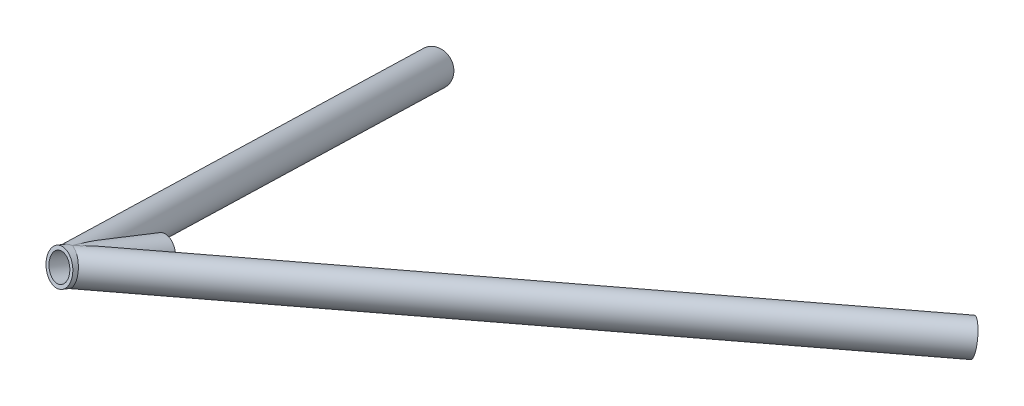
ISO-10303-21;
HEADER;
FILE_DESCRIPTION(('STEP AP214'),'2;1');
FILE_NAME('part.step','',(''),(''),'','','');
FILE_SCHEMA(('AUTOMOTIVE_DESIGN { 1 0 10303 214 1 1 1 1 }'));
ENDSEC;
DATA;
#1=APPLICATION_CONTEXT('core data for automotive mechanical design processes');
#2=APPLICATION_PROTOCOL_DEFINITION('international standard','automotive_design',2000,#1);
#3=PRODUCT_CONTEXT('',#1,'mechanical');
#4=PRODUCT('Part','Part','',(#3));
#5=PRODUCT_RELATED_PRODUCT_CATEGORY('part','',(#4));
#6=PRODUCT_DEFINITION_FORMATION('','',#4);
#7=PRODUCT_DEFINITION_CONTEXT('part definition',#1,'design');
#8=PRODUCT_DEFINITION('design','',#6,#7);
#9=PRODUCT_DEFINITION_SHAPE('','',#8);
#10=(LENGTH_UNIT() NAMED_UNIT(*) SI_UNIT(.MILLI.,.METRE.));
#11=(NAMED_UNIT(*) PLANE_ANGLE_UNIT() SI_UNIT($,.RADIAN.));
#12=(NAMED_UNIT(*) SI_UNIT($,.STERADIAN.) SOLID_ANGLE_UNIT());
#13=UNCERTAINTY_MEASURE_WITH_UNIT(LENGTH_MEASURE(1.E-05),#10,'distance_accuracy_value','');
#14=(GEOMETRIC_REPRESENTATION_CONTEXT(3) GLOBAL_UNCERTAINTY_ASSIGNED_CONTEXT((#13)) GLOBAL_UNIT_ASSIGNED_CONTEXT((#10,
#11,#12)) REPRESENTATION_CONTEXT('',''));
#15=CARTESIAN_POINT('',(0.,0.,0.));
#16=DIRECTION('',(0.,0.,1.));
#17=DIRECTION('',(1.,0.,0.));
#18=AXIS2_PLACEMENT_3D('',#15,#16,#17);
#19=CARTESIAN_POINT('',(1696.18593125395,298.313265774571,609.984435723738));
#20=DIRECTION('',(0.586936783063146,-0.193365264339262,-0.786202955498447));
#21=DIRECTION('',(-0.801326519780633,0.,-0.598227221627584));
#22=AXIS2_PLACEMENT_3D('',#19,#20,#21);
#23=CYLINDRICAL_SURFACE('',#22,7.41680000000007);
#24=CARTESIAN_POINT('',(1929.45721259279,221.462462961638,297.517103442446));
#25=DIRECTION('',(-0.586936783063146,0.193365264339262,0.786202955498447));
#26=DIRECTION('',(0.801326519780633,0.,0.598227221627584));
#27=AXIS2_PLACEMENT_3D('',#24,#25,#26);
#28=CIRCLE('',#27,7.41680000000007);
#29=CARTESIAN_POINT('',(1935.4004911247,221.462462961638,301.954035099813));
#30=VERTEX_POINT('',#29);
#31=EDGE_CURVE('E109',#30,#30,#28,.T.);
#32=ORIENTED_EDGE('',*,*,#31,.F.);
#33=EDGE_LOOP('',(#32));
#34=FACE_BOUND('',#33,.T.);
#35=CARTESIAN_POINT('',(1712.03955486723,291.132315684709,576.350511508126));
#36=CARTESIAN_POINT('',(1712.07658497035,291.016248629587,576.300908607568));
#37=CARTESIAN_POINT('',(1712.11207509683,290.897242727666,576.256864690043));
#38=CARTESIAN_POINT('',(1712.17864311787,290.653362032852,576.183487458711));
#39=CARTESIAN_POINT('',(1712.20971879644,290.52848433398,576.154161514517));
#40=CARTESIAN_POINT('',(1712.26594423027,290.27230217174,576.114550975179));
#41=CARTESIAN_POINT('',(1712.29100463676,290.140932082762,576.1045395689));
#42=CARTESIAN_POINT('',(1712.33218706204,289.877324729745,576.109257153488));
#43=CARTESIAN_POINT('',(1712.34833512454,289.74509114725,576.12391354621));
#44=CARTESIAN_POINT('',(1712.36873326322,289.500791048101,576.176674578998));
#45=CARTESIAN_POINT('',(1712.37416018927,289.388182955529,576.21181578729));
#46=CARTESIAN_POINT('',(1712.37668060772,289.170742355862,576.301338622151));
#47=CARTESIAN_POINT('',(1712.37376445541,289.065918991679,576.355742452868));
#48=CARTESIAN_POINT('',(1712.35948631222,288.850410188001,576.49016313902));
#49=CARTESIAN_POINT('',(1712.3468294117,288.741538143218,576.572904944146));
#50=CARTESIAN_POINT('',(1712.31382051871,288.53810421147,576.753064671234));
#51=CARTESIAN_POINT('',(1712.29345401726,288.443569779741,576.850510055139));
#52=CARTESIAN_POINT('',(1712.25053414276,288.280529543587,577.039905272961));
#53=CARTESIAN_POINT('',(1712.22875111139,288.21024232212,577.130532365055));
#54=CARTESIAN_POINT('',(1712.18204352185,288.07780028612,577.31683563695));
#55=CARTESIAN_POINT('',(1712.15711652896,288.015651851273,577.412515696118));
#56=CARTESIAN_POINT('',(1712.10479601727,287.898263920755,577.607647609773));
#57=CARTESIAN_POINT('',(1712.07739689197,287.843040844464,577.707107725782));
#58=CARTESIAN_POINT('',(1712.02071898795,287.738682589971,577.908580036128));
#59=CARTESIAN_POINT('',(1711.9914407935,287.68954553322,578.010591431227));
#60=CARTESIAN_POINT('',(1711.91693730902,287.574089366037,578.266078100127));
#61=CARTESIAN_POINT('',(1711.87081821702,287.51088127217,578.420694893387));
#62=CARTESIAN_POINT('',(1711.77617789931,287.393734608016,578.732714793343));
#63=CARTESIAN_POINT('',(1711.72765543724,287.339800873888,578.890119306809));
#64=CARTESIAN_POINT('',(1711.62872894047,287.239552813774,579.207061835553));
#65=CARTESIAN_POINT('',(1711.57832175554,287.193252014725,579.366603108042));
#66=CARTESIAN_POINT('',(1711.47611842774,287.107161490387,579.686996390202));
#67=CARTESIAN_POINT('',(1711.42432212099,287.067372537371,579.847848552966));
#68=CARTESIAN_POINT('',(1711.31934552606,286.993160402487,580.171398701596));
#69=CARTESIAN_POINT('',(1711.26615899138,286.958769397608,580.334101982764));
#70=CARTESIAN_POINT('',(1711.15891679189,286.894881224651,580.660180432866));
#71=CARTESIAN_POINT('',(1711.10486109718,286.86538422524,580.823555624758));
#72=CARTESIAN_POINT('',(1710.99612147059,286.810721823565,581.150594661971));
#73=CARTESIAN_POINT('',(1710.94143836376,286.78555130336,581.314257931626));
#74=CARTESIAN_POINT('',(1710.83151783514,286.739022711283,581.6419327401));
#75=CARTESIAN_POINT('',(1710.77628041941,286.717664597761,581.805944275096));
#76=CARTESIAN_POINT('',(1710.61641090879,286.66101009951,582.279098936916));
#77=CARTESIAN_POINT('',(1710.51121193253,286.630049333578,582.588573444953));
#78=CARTESIAN_POINT('',(1710.29979138591,286.578181544837,583.208032451481));
#79=CARTESIAN_POINT('',(1710.19356967737,286.557275900549,583.518017014057));
#80=CARTESIAN_POINT('',(1709.98047083585,286.524065369149,584.138370852052));
#81=CARTESIAN_POINT('',(1709.87359342688,286.511764396117,584.448740238297));
#82=CARTESIAN_POINT('',(1709.65954871433,286.494684108432,585.069595275297));
#83=CARTESIAN_POINT('',(1709.55238139593,286.489905185709,585.380080931267));
#84=CARTESIAN_POINT('',(1709.33777682453,286.487030671917,586.00180972391));
#85=CARTESIAN_POINT('',(1709.23033953401,286.488950954797,586.313052911034));
#86=CARTESIAN_POINT('',(1709.01568785097,286.498863734382,586.935522774005));
#87=CARTESIAN_POINT('',(1708.90847346486,286.506856402979,587.246749449136));
#88=CARTESIAN_POINT('',(1708.587564373,286.539144850831,588.180189080425));
#89=CARTESIAN_POINT('',(1708.3745366263,286.571750871382,588.802355268866));
#90=CARTESIAN_POINT('',(1707.952316236,286.656247492503,590.045737529847));
#91=CARTESIAN_POINT('',(1707.74311896728,286.708112970963,590.666953786179));
#92=CARTESIAN_POINT('',(1707.33019693435,286.829636965709,591.909537830945));
#93=CARTESIAN_POINT('',(1707.12647276677,286.899297413179,592.530905628508));
#94=CARTESIAN_POINT('',(1706.72723866972,287.055779916383,593.77306265047));
#95=CARTESIAN_POINT('',(1706.53171643825,287.142575068174,594.393851268229));
#96=CARTESIAN_POINT('',(1706.24682508677,287.28613974271,595.325480851698));
#97=CARTESIAN_POINT('',(1706.15326499031,287.336220102417,595.636081023833));
#98=CARTESIAN_POINT('',(1705.96948073648,287.441054385257,596.257476901621));
#99=CARTESIAN_POINT('',(1705.87925652701,287.495808235362,596.568272604145));
#100=CARTESIAN_POINT('',(1705.66884575387,287.632280011369,597.309592790259));
#101=CARTESIAN_POINT('',(1705.55047230958,287.7162727698,597.740220382242));
#102=CARTESIAN_POINT('',(1705.32342652983,287.895009065529,598.601939264552));
#103=CARTESIAN_POINT('',(1705.21475658885,287.989755243362,599.033030642912));
#104=CARTESIAN_POINT('',(1705.01006728148,288.191851247254,599.895132005038));
#105=CARTESIAN_POINT('',(1704.9140421744,288.299195311779,600.326141936415));
#106=CARTESIAN_POINT('',(1704.78244967651,288.471904816642,600.972009696426));
#107=CARTESIAN_POINT('',(1704.74066305203,288.531417401198,601.187170871958));
#108=CARTESIAN_POINT('',(1704.66187153557,288.65487055869,601.617092313928));
#109=CARTESIAN_POINT('',(1704.62486638679,288.718810893548,601.831852601285));
#110=CARTESIAN_POINT('',(1704.54476534034,288.874205525519,602.333200559642));
#111=CARTESIAN_POINT('',(1704.50383897657,288.967654251779,602.619528522018));
#112=CARTESIAN_POINT('',(1704.43384741731,289.165486774651,603.189963268197));
#113=CARTESIAN_POINT('',(1704.40478422379,289.269872413183,603.474069669174));
#114=CARTESIAN_POINT('',(1704.36094240185,289.491798423494,604.03771681313));
#115=CARTESIAN_POINT('',(1704.34613858625,289.609315189554,604.31726474588));
#116=CARTESIAN_POINT('',(1704.33329796318,289.860596570841,604.869367488304));
#117=CARTESIAN_POINT('',(1704.33525181188,289.994352090569,605.141926110084));
#118=CARTESIAN_POINT('',(1704.35426843521,290.232517457915,605.584704388796));
#119=CARTESIAN_POINT('',(1704.36595361321,290.331387510807,605.758137095597));
#120=CARTESIAN_POINT('',(1704.39799239082,290.538592473899,606.098396846474));
#121=CARTESIAN_POINT('',(1704.41834295773,290.646924062236,606.265226179281));
#122=CARTESIAN_POINT('',(1704.46776436013,290.873770016219,606.590201417726));
#123=CARTESIAN_POINT('',(1704.49682471037,290.992272016521,606.748357495322));
#124=CARTESIAN_POINT('',(1704.56326373124,291.240145567829,607.054089563841));
#125=CARTESIAN_POINT('',(1704.60064219554,291.369516849172,607.201665817077));
#126=CARTESIAN_POINT('',(1704.68311811871,291.640619794724,607.485491521252));
#127=CARTESIAN_POINT('',(1704.72828560426,291.78245730518,607.621619908406));
#128=CARTESIAN_POINT('',(1704.82447361544,292.077179649872,607.879072530503));
#129=CARTESIAN_POINT('',(1704.87549426741,292.230064722526,608.000396445798));
#130=CARTESIAN_POINT('',(1704.98132967104,292.546278093969,608.226880518623));
#131=CARTESIAN_POINT('',(1705.03614642522,292.709611901163,608.332032049229));
#132=CARTESIAN_POINT('',(1705.14720860748,293.045617626346,608.525251546435));
#133=CARTESIAN_POINT('',(1705.20345395814,293.218289038873,608.613320436571));
#134=CARTESIAN_POINT('',(1705.30837622991,293.550679829153,608.762647489244));
#135=CARTESIAN_POINT('',(1705.35715802747,293.709498801764,608.825848254794));
#136=CARTESIAN_POINT('',(1705.45248350064,294.032461888309,608.938857730564));
#137=CARTESIAN_POINT('',(1705.49902740069,294.196605465476,608.988667786012));
#138=CARTESIAN_POINT('',(1705.58852376935,294.529276010192,609.075171276163));
#139=CARTESIAN_POINT('',(1705.63147593536,294.69780334551,609.111863606543));
#140=CARTESIAN_POINT('',(1705.71261039163,295.038266432537,609.172510059636));
#141=CARTESIAN_POINT('',(1705.75079239992,295.210202385042,609.19646342959));
#142=CARTESIAN_POINT('',(1705.82309969626,295.564865641273,609.232924731367));
#143=CARTESIAN_POINT('',(1705.85694056217,295.747713503338,609.244825019672));
#144=CARTESIAN_POINT('',(1705.91737346114,296.114980798895,609.255627149784));
#145=CARTESIAN_POINT('',(1705.94396535543,296.299400262402,609.254528742776));
#146=CARTESIAN_POINT('',(1705.98919598081,296.668744074213,609.239840107601));
#147=CARTESIAN_POINT('',(1706.00783345101,296.853668497888,609.226247900067));
#148=CARTESIAN_POINT('',(1706.0366374073,297.222903596839,609.187043675306));
#149=CARTESIAN_POINT('',(1706.04680359533,297.407214250293,609.1614312352));
#150=CARTESIAN_POINT('',(1706.05866768977,297.784757426962,609.096797170882));
#151=CARTESIAN_POINT('',(1706.05984126695,297.977888725907,609.057085089235));
#152=CARTESIAN_POINT('',(1706.05215826392,298.360949181745,608.965140535468));
#153=CARTESIAN_POINT('',(1706.04330128961,298.550878212518,608.912907571446));
#154=CARTESIAN_POINT('',(1706.01558840952,298.926268314493,608.796297006398));
#155=CARTESIAN_POINT('',(1705.99673050142,299.111728483189,608.731916975022));
#156=CARTESIAN_POINT('',(1705.94925953409,299.476832263983,608.591343453487));
#157=CARTESIAN_POINT('',(1705.92064647299,299.656475874966,608.515149961061));
#158=CARTESIAN_POINT('',(1705.8536084474,300.01136652067,608.349938638769));
#159=CARTESIAN_POINT('',(1705.81503816357,300.186502127179,608.260740209218));
#160=CARTESIAN_POINT('',(1705.7290308067,300.528037493043,608.070645091176));
#161=CARTESIAN_POINT('',(1705.68159356712,300.69443708822,607.969748182946));
#162=CARTESIAN_POINT('',(1705.57882728298,301.017119334387,607.756420050968));
#163=CARTESIAN_POINT('',(1705.52349776992,301.173401383967,607.643988142578));
#164=CARTESIAN_POINT('',(1705.4062046115,301.474454049306,607.407741797848));
#165=CARTESIAN_POINT('',(1705.34424113265,301.619224953808,607.283927647184));
#166=CARTESIAN_POINT('',(1705.21647409177,301.893242186314,607.027569489089));
#167=CARTESIAN_POINT('',(1705.15076745947,302.022733790484,606.895239513668));
#168=CARTESIAN_POINT('',(1705.01621125525,302.268144654332,606.619999881119));
#169=CARTESIAN_POINT('',(1704.94736172586,302.384064097564,606.477090367116));
#170=CARTESIAN_POINT('',(1704.80858898827,302.601163358166,606.181177102642));
#171=CARTESIAN_POINT('',(1704.73866678405,302.702356127568,606.028182396257));
#172=CARTESIAN_POINT('',(1704.5998950309,302.889276124267,605.712562706909));
#173=CARTESIAN_POINT('',(1704.53104539699,302.975004582326,605.549938491701));
#174=CARTESIAN_POINT('',(1704.40117202867,303.125323263886,605.227052195232));
#175=CARTESIAN_POINT('',(1704.33993250385,303.190941240857,605.067354524121));
#176=CARTESIAN_POINT('',(1704.22214045227,303.308232177363,604.741266988864));
#177=CARTESIAN_POINT('',(1704.16558751942,303.359906345979,604.574877706392));
#178=CARTESIAN_POINT('',(1704.05872075458,303.449644490273,604.236601319506));
#179=CARTESIAN_POINT('',(1704.0084046057,303.487713530049,604.064716286726));
#180=CARTESIAN_POINT('',(1703.91514782067,303.55100641991,603.716639111886));
#181=CARTESIAN_POINT('',(1703.87220807618,303.576228717816,603.540446452059));
#182=CARTESIAN_POINT('',(1703.78520758005,303.619457308225,603.142781500165));
#183=CARTESIAN_POINT('',(1703.74330303626,303.634326728683,602.920494414113));
#184=CARTESIAN_POINT('',(1703.67239126969,303.648368121494,602.47340078925));
#185=CARTESIAN_POINT('',(1703.64338774189,303.647535599609,602.248593547517));
#186=CARTESIAN_POINT('',(1703.5978495116,303.632657832155,601.797727012063));
#187=CARTESIAN_POINT('',(1703.58134151676,303.61858442893,601.571666070991));
#188=CARTESIAN_POINT('',(1703.55997707323,303.579527039727,601.120001136951));
#189=CARTESIAN_POINT('',(1703.55512026607,303.554543389448,600.894397130138));
#190=CARTESIAN_POINT('',(1703.5559323487,303.491742714728,600.414230301334));
#191=CARTESIAN_POINT('',(1703.5630999596,303.452654070101,600.159840792459));
#192=CARTESIAN_POINT('',(1703.58911866983,303.365420496443,599.653177006584));
#193=CARTESIAN_POINT('',(1703.60797435236,303.317272019988,599.400903598709));
#194=CARTESIAN_POINT('',(1703.65572407664,303.213680985801,598.898446807011));
#195=CARTESIAN_POINT('',(1703.68463333582,303.158227450381,598.648267183648));
#196=CARTESIAN_POINT('',(1703.75098934619,303.041478162259,598.150473507433));
#197=CARTESIAN_POINT('',(1703.78843509029,302.9801830992,597.902859155546));
#198=CARTESIAN_POINT('',(1703.87087758781,302.852339427442,597.408400278013));
#199=CARTESIAN_POINT('',(1703.91592475676,302.785757427161,597.161572910494));
#200=CARTESIAN_POINT('',(1704.0122978258,302.648497064351,596.670302154552));
#201=CARTESIAN_POINT('',(1704.06362384223,302.577818625928,596.425858810395));
#202=CARTESIAN_POINT('',(1704.17159937122,302.433011152021,595.939430989684));
#203=CARTESIAN_POINT('',(1704.22824420519,302.358885177529,595.697444555818));
#204=CARTESIAN_POINT('',(1704.34614364864,302.207554832535,595.215572877502));
#205=CARTESIAN_POINT('',(1704.40739826788,302.130350455509,594.975687637506));
#206=CARTESIAN_POINT('',(1704.5467859319,301.957156780336,594.449160561819));
#207=CARTESIAN_POINT('',(1704.62581357066,301.860547406341,594.162959869139));
#208=CARTESIAN_POINT('',(1704.7887467536,301.663719654699,593.59319492726));
#209=CARTESIAN_POINT('',(1704.87265253049,301.563501104967,593.309630804584));
#210=CARTESIAN_POINT('',(1705.13058945763,301.257820598425,592.462536584149));
#211=CARTESIAN_POINT('',(1705.31081776212,301.047361283926,591.902687588168));
#212=CARTESIAN_POINT('',(1705.6836465492,300.613953135062,590.791188069946));
#213=CARTESIAN_POINT('',(1705.87626226424,300.390988968622,590.239548709899));
#214=CARTESIAN_POINT('',(1706.27068153954,299.932914349967,589.144741210977));
#215=CARTESIAN_POINT('',(1706.47248416153,299.697805137811,588.601572214588));
#216=CARTESIAN_POINT('',(1706.88215539226,299.216002668607,587.526206723237));
#217=CARTESIAN_POINT('',(1707.08999035675,298.969370220874,586.993970162816));
#218=CARTESIAN_POINT('',(1707.51105714415,298.462282324065,585.938218662376));
#219=CARTESIAN_POINT('',(1707.7242894323,298.201825681233,585.414704480703));
#220=CARTESIAN_POINT('',(1708.15460034563,297.665546212208,584.378035458822));
#221=CARTESIAN_POINT('',(1708.37167423167,297.389741526229,583.86486932628));
#222=CARTESIAN_POINT('',(1708.69945495501,296.962200910789,583.103898382084));
#223=CARTESIAN_POINT('',(1708.80906955099,296.817391771962,582.851720770466));
#224=CARTESIAN_POINT('',(1709.02888266129,296.522653990563,582.350637886731));
#225=CARTESIAN_POINT('',(1709.13908116027,296.372725482014,582.101732529183));
#226=CARTESIAN_POINT('',(1709.38945334214,296.026272747809,581.541531209966));
#227=CARTESIAN_POINT('',(1709.52975832569,295.828014426476,581.231360573142));
#228=CARTESIAN_POINT('',(1709.81072055274,295.420670961973,580.618215387168));
#229=CARTESIAN_POINT('',(1709.95137788129,295.211582903126,580.315242808305));
#230=CARTESIAN_POINT('',(1710.23289469247,294.779844509073,579.717717254329));
#231=CARTESIAN_POINT('',(1710.37375373002,294.557159862633,579.423188589689));
#232=CARTESIAN_POINT('',(1710.58427563444,294.210981826128,578.990870864079));
#233=CARTESIAN_POINT('',(1710.65430818037,294.09358816069,578.848371160794));
#234=CARTESIAN_POINT('',(1710.79397854943,293.854173791045,578.567123597279));
#235=CARTESIAN_POINT('',(1710.86361640467,293.732153469661,578.428375428255));
#236=CARTESIAN_POINT('',(1711.01390714151,293.461958055479,578.13257659927));
#237=CARTESIAN_POINT('',(1711.09445464047,293.31282143593,577.97634529486));
#238=CARTESIAN_POINT('',(1711.25427434336,293.00598957127,577.671885138285));
#239=CARTESIAN_POINT('',(1711.33354699889,292.848297447432,577.523653406513));
#240=CARTESIAN_POINT('',(1711.48966857923,292.523397497416,577.238686306058));
#241=CARTESIAN_POINT('',(1711.56652852091,292.356247391498,577.101891654054));
#242=CARTESIAN_POINT('',(1711.71698221622,292.00945358416,576.84332265971));
#243=CARTESIAN_POINT('',(1711.79058114109,291.829830914455,576.721523948483));
#244=CARTESIAN_POINT('',(1711.89235972764,291.560638171652,576.56260808444));
#245=CARTESIAN_POINT('',(1711.92279035208,291.477277852551,576.516409730959));
#246=CARTESIAN_POINT('',(1711.98229705649,291.307286152517,576.429235128493));
#247=CARTESIAN_POINT('',(1712.01137197277,291.220652072912,576.388263315261));
#248=CARTESIAN_POINT('',(1712.03955486723,291.132315684709,576.350511508126));
#249=B_SPLINE_CURVE_WITH_KNOTS('',3,(#35,#36,#37,#38,#39,#40,#41,#42,#43,#44,#45,#46,#47,#48,
#49,#50,#51,#52,#53,#54,#55,#56,#57,#58,#59,#60,#61,#62,#63,#64,#65,#66,#67,#68,#69,#70,#71,#72,
#73,#74,#75,#76,#77,#78,#79,#80,#81,#82,#83,#84,#85,#86,#87,#88,#89,#90,#91,#92,#93,#94,#95,#96,
#97,#98,#99,#100,#101,#102,#103,#104,#105,#106,#107,#108,#109,#110,#111,#112,#113,#114,#115,
#116,#117,#118,#119,#120,#121,#122,#123,#124,#125,#126,#127,#128,#129,#130,#131,#132,#133,#134,
#135,#136,#137,#138,#139,#140,#141,#142,#143,#144,#145,#146,#147,#148,#149,#150,#151,#152,#153,
#154,#155,#156,#157,#158,#159,#160,#161,#162,#163,#164,#165,#166,#167,#168,#169,#170,#171,#172,
#173,#174,#175,#176,#177,#178,#179,#180,#181,#182,#183,#184,#185,#186,#187,#188,#189,#190,#191,
#192,#193,#194,#195,#196,#197,#198,#199,#200,#201,#202,#203,#204,#205,#206,#207,#208,#209,#210,
#211,#212,#213,#214,#215,#216,#217,#218,#219,#220,#221,#222,#223,#224,#225,#226,#227,#228,#229,
#230,#231,#232,#233,#234,#235,#236,#237,#238,#239,#240,#241,#242,#243,#244,#245,#246,#247,#248),
.UNSPECIFIED.,.T.,.F.,(4,2,2,2,2,2,2,2,2,2,2,2,2,2,2,2,2,2,2,2,2,2,2,2,2,2,2,2,2,2,2,2,2,2,2,2,
2,2,2,2,2,2,2,2,2,2,2,2,2,2,2,2,2,2,2,2,2,2,2,2,2,2,2,2,2,2,2,2,2,2,2,2,2,2,2,2,2,2,2,2,2,2,2,2,
2,2,2,2,2,2,2,2,2,2,2,2,2,2,2,2,2,2,2,2,2,2,4),(0.,0.394479960414139,0.789157249077542,
1.18937714890788,1.58842124686282,1.94048993548404,2.29296578432835,2.70269383345527,
3.11319682899353,3.46291656384146,3.81290881050168,4.16371576864112,4.51441417317343,
5.03388223412165,5.55362035807055,6.07426987419945,6.59498109210988,7.11868713993254,
7.64241123281382,8.16551146586819,8.68860598382093,9.67338228691278,10.6582935608705,
11.6436525590599,12.6290628971506,13.6168097760679,14.6045846163618,16.5795198556668,
18.5518879798443,20.5244702445624,22.4939795593056,23.4786235686581,24.463252194514,
25.8263424742537,27.1897681921569,28.5525727713968,29.233846823071,29.9150842714979,
30.8266012439973,31.7382719753394,32.6483293992263,33.5578794217347,34.1573692895057,
34.7566495212298,35.3552111897963,35.9537580127405,36.5579969772525,37.162248985774,
37.7668222140867,38.3713627483271,38.9040382537944,39.4366602267603,39.9693270282317,
40.5020253020805,41.0604121793175,41.6188097449805,42.1772957916484,42.7358014875993,
43.3266408704121,43.9175034690095,44.5084844112902,45.0994654669226,45.6996139564552,
46.2997737207312,46.8999691272002,47.5001494737875,48.0887718405203,48.6773862456055,
49.2654797976725,49.8535265243029,50.4023971895076,50.9512202462929,51.4998388070191,
52.0485236376751,52.7275318486041,53.4067344093505,54.0873846141912,54.7680138774823,
55.5399089711857,56.3121069356948,57.0854788492107,57.8587595723828,58.6373865266265,
59.4160279109717,60.1939906843298,60.9719551066907,61.9085698345909,62.8452292791281,
64.7188186691671,66.5947577232883,68.4705056137101,70.3372785186765,72.2042128875395,
74.068985707636,75.0012492684392,75.9334884415991,77.115155291376,78.2971419503623,
79.4822456468993,80.0745654263381,80.6668363017866,81.358149842198,82.0492128473245,
82.7364373368713,83.4225298965663,83.722508035468,84.0227390948778),.UNSPECIFIED.);
#250=CARTESIAN_POINT('',(1712.03955486723,291.132315684709,576.350511508126));
#251=VERTEX_POINT('',#250);
#252=EDGE_CURVE('E83',#251,#251,#249,.T.);
#253=ORIENTED_EDGE('',*,*,#252,.T.);
#254=EDGE_LOOP('',(#253));
#255=FACE_BOUND('',#254,.T.);
#256=ADVANCED_FACE('F65',(#34,#255),#23,.F.);
#257=CARTESIAN_POINT('',(1695.27005223557,299.62724687487,614.720955468418));
#258=DIRECTION('',(0.18317580367567,-0.262796220059855,-0.94730394893615));
#259=DIRECTION('',(0.,0.963608030897897,-0.267319215151245));
#260=AXIS2_PLACEMENT_3D('',#257,#258,#259);
#261=CYLINDRICAL_SURFACE('',#260,9.52500000000009);
#262=ORIENTED_EDGE('',*,*,#252,.F.);
#263=EDGE_LOOP('',(#262));
#264=FACE_BOUND('',#263,.T.);
#265=CARTESIAN_POINT('',(1696.18593125395,298.313265774571,609.984435723737));
#266=DIRECTION('',(0.394737380314413,-0.233815149177805,-0.88854537115303));
#267=DIRECTION('',(0.917171793543887,0.157717356150483,0.365952369436776));
#268=AXIS2_PLACEMENT_3D('',#265,#266,#267);
#269=ELLIPSE('',#268,9.76447759000194,9.52500000000002);
#270=CARTESIAN_POINT('',(1696.70574687903,289.174944281087,612.620056523028));
#271=VERTEX_POINT('',#270);
#272=CARTESIAN_POINT('',(1695.66611562887,307.451587268054,607.348814924446));
#273=VERTEX_POINT('',#272);
#274=EDGE_CURVE('E74',#271,#273,#269,.F.);
#275=ORIENTED_EDGE('',*,*,#274,.T.);
#276=CARTESIAN_POINT('',(1696.18593125395,298.313265774571,609.984435723737));
#277=DIRECTION('',(0.917171793543887,0.157717356150483,0.365952369436776));
#278=DIRECTION('',(0.394737380314413,-0.233815149177805,-0.88854537115303));
#279=AXIS2_PLACEMENT_3D('',#276,#277,#278);
#280=ELLIPSE('',#279,43.2734304674936,9.52500000000002);
#281=EDGE_CURVE('E13',#273,#271,#280,.F.);
#282=ORIENTED_EDGE('',*,*,#281,.T.);
#283=EDGE_LOOP('',(#275,#282));
#284=FACE_BOUND('',#283,.T.);
#285=ADVANCED_FACE('F81',(#264,#284),#261,.F.);
#286=CARTESIAN_POINT('',(1696.18593125395,298.313265774571,609.984435723738));
#287=DIRECTION('',(0.586936783063146,-0.193365264339262,-0.786202955498447));
#288=DIRECTION('',(-0.801326519780633,0.,-0.598227221627584));
#289=AXIS2_PLACEMENT_3D('',#286,#287,#288);
#290=CYLINDRICAL_SURFACE('',#289,9.52499999999996);
#291=CARTESIAN_POINT('',(1929.45721259279,221.462462961638,297.517103442446));
#292=DIRECTION('',(-0.586936783063146,0.193365264339262,0.786202955498447));
#293=DIRECTION('',(0.801326519780633,0.,0.598227221627584));
#294=AXIS2_PLACEMENT_3D('',#291,#292,#293);
#295=CIRCLE('',#294,9.52499999999996);
#296=CARTESIAN_POINT('',(1937.0898476937,221.462462961638,303.215217728448));
#297=VERTEX_POINT('',#296);
#298=EDGE_CURVE('E69',#297,#297,#295,.T.);
#299=ORIENTED_EDGE('',*,*,#298,.T.);
#300=EDGE_LOOP('',(#299));
#301=FACE_BOUND('',#300,.T.);
#302=ORIENTED_EDGE('',*,*,#274,.F.);
#303=ORIENTED_EDGE('',*,*,#281,.F.);
#304=EDGE_LOOP('',(#302,#303));
#305=FACE_BOUND('',#304,.T.);
#306=ADVANCED_FACE('F67',(#301,#305),#290,.T.);
#307=CARTESIAN_POINT('',(1929.45721259279,221.462462961638,297.517103442446));
#308=DIRECTION('',(-0.586936783063146,0.193365264339262,0.786202955498447));
#309=DIRECTION('',(0.801326519780633,0.,0.598227221627584));
#310=AXIS2_PLACEMENT_3D('',#307,#308,#309);
#311=PLANE('',#310);
#312=ORIENTED_EDGE('',*,*,#31,.T.);
#313=EDGE_LOOP('',(#312));
#314=FACE_BOUND('',#313,.T.);
#315=ORIENTED_EDGE('',*,*,#298,.F.);
#316=EDGE_LOOP('',(#315));
#317=FACE_BOUND('',#316,.T.);
#318=ADVANCED_FACE('F86',(#314,#317),#311,.F.);
#319=CLOSED_SHELL('',(#256,#285,#306,#318));
#320=MANIFOLD_SOLID_BREP('B2',#319);
#321=CARTESIAN_POINT('',(1600.,194.785610189008,270.));
#322=DIRECTION('',(0.261244511464905,0.281184903592084,0.923410177126814));
#323=DIRECTION('',(0.,-0.956631443980582,0.291301013365261));
#324=AXIS2_PLACEMENT_3D('',#321,#322,#323);
#325=CYLINDRICAL_SURFACE('',#324,7.41680000000007);
#326=CARTESIAN_POINT('',(1609.14355790127,204.627081814731,302.319356199439));
#327=DIRECTION('',(0.261244511464905,0.281184903592084,0.923410177126814));
#328=DIRECTION('',(0.,-0.956631443980581,0.291301013365261));
#329=AXIS2_PLACEMENT_3D('',#326,#327,#328);
#330=CIRCLE('',#329,7.41680000000007);
#331=CARTESIAN_POINT('',(1609.14355790127,197.531937721016,304.479877555366));
#332=VERTEX_POINT('',#331);
#333=EDGE_CURVE('E184',#332,#332,#330,.T.);
#334=ORIENTED_EDGE('',*,*,#333,.F.);
#335=EDGE_LOOP('',(#334));
#336=FACE_BOUND('',#335,.T.);
#337=CARTESIAN_POINT('',(1692.80899171428,287.583425535191,600.208628461756));
#338=CARTESIAN_POINT('',(1692.8639822694,287.511107247045,599.971138501752));
#339=CARTESIAN_POINT('',(1692.91523866587,287.441230702867,599.732040339298));
#340=CARTESIAN_POINT('',(1693.01128496172,287.305691435197,599.251349878067));
#341=CARTESIAN_POINT('',(1693.05607406018,287.240029234167,599.009757274343));
#342=CARTESIAN_POINT('',(1693.1400571916,287.11238606106,598.524525649544));
#343=CARTESIAN_POINT('',(1693.17924875882,287.050406718274,598.280885776369));
#344=CARTESIAN_POINT('',(1693.25274230743,286.929768019205,597.792046417658));
#345=CARTESIAN_POINT('',(1693.28704401484,286.87110884906,597.546846845535));
#346=CARTESIAN_POINT('',(1693.38369839215,286.699416204381,596.808395251278));
#347=CARTESIAN_POINT('',(1693.43964085469,286.590915190542,596.313243936816));
#348=CARTESIAN_POINT('',(1693.53836081826,286.38441717947,595.319632358329));
#349=CARTESIAN_POINT('',(1693.58114127334,286.286417828491,594.821172862479));
#350=CARTESIAN_POINT('',(1693.65654903037,286.099574102431,593.81896586568));
#351=CARTESIAN_POINT('',(1693.68911977823,286.010782483443,593.315204349907));
#352=CARTESIAN_POINT('',(1693.74587391296,285.842650823687,592.305620899133));
#353=CARTESIAN_POINT('',(1693.77005685364,285.763311285874,591.799798855968));
#354=CARTESIAN_POINT('',(1693.81154289898,285.614275750013,590.787157156084));
#355=CARTESIAN_POINT('',(1693.82885523119,285.544566900149,590.280339762402));
#356=CARTESIAN_POINT('',(1693.85779515772,285.415089960422,589.265289822192));
#357=CARTESIAN_POINT('',(1693.8694229407,285.355321540693,588.757057323192));
#358=CARTESIAN_POINT('',(1693.88603244484,285.257268075335,587.84012707452));
#359=CARTESIAN_POINT('',(1693.89187427465,285.217072529904,587.431648385249));
#360=CARTESIAN_POINT('',(1693.90080146888,285.144145972156,586.613994600742));
#361=CARTESIAN_POINT('',(1693.90388685982,285.111414887977,586.204819512249));
#362=CARTESIAN_POINT('',(1693.90757868103,285.054156579552,585.385474821867));
#363=CARTESIAN_POINT('',(1693.90818266903,285.029637459469,584.975304637568));
#364=CARTESIAN_POINT('',(1693.90711848645,284.989875294927,584.15452325771));
#365=CARTESIAN_POINT('',(1693.90545039112,284.97463194326,583.743912077209));
#366=CARTESIAN_POINT('',(1693.90002349966,284.954880410247,582.925941586555));
#367=CARTESIAN_POINT('',(1693.89628269023,284.950281610597,582.518584470524));
#368=CARTESIAN_POINT('',(1693.886825032,284.95338806345,581.703955956813));
#369=CARTESIAN_POINT('',(1693.88110833283,284.961092384409,581.296684554978));
#370=CARTESIAN_POINT('',(1693.86775398958,284.991334035881,580.483194438576));
#371=CARTESIAN_POINT('',(1693.86011885493,285.013852050936,580.076975043815));
#372=CARTESIAN_POINT('',(1693.84720773639,285.061582247416,579.468841287777));
#373=CARTESIAN_POINT('',(1693.8426617,285.079814309669,579.266357551059));
#374=CARTESIAN_POINT('',(1693.83307152394,285.121595488103,578.861955159232));
#375=CARTESIAN_POINT('',(1693.82802741835,285.145144240624,578.660036466429));
#376=CARTESIAN_POINT('',(1693.81805760691,285.195188733485,578.281118120289));
#377=CARTESIAN_POINT('',(1693.81318989179,285.220995171703,578.104026419644));
#378=CARTESIAN_POINT('',(1693.80303626502,285.27807271536,577.750709083352));
#379=CARTESIAN_POINT('',(1693.79775030838,285.309344409098,577.574483543044));
#380=CARTESIAN_POINT('',(1693.78670380117,285.378451517512,577.222238832251));
#381=CARTESIAN_POINT('',(1693.78094062108,285.416324771143,577.046227088337));
#382=CARTESIAN_POINT('',(1693.76893506836,285.499682438771,576.696044139799));
#383=CARTESIAN_POINT('',(1693.76269278434,285.545165447078,576.521872601555));
#384=CARTESIAN_POINT('',(1693.74958304178,285.646089894957,576.173471178736));
#385=CARTESIAN_POINT('',(1693.74270734201,285.701675768874,575.999282865821));
#386=CARTESIAN_POINT('',(1693.72834956183,285.824584390309,575.654844845826));
#387=CARTESIAN_POINT('',(1693.72086687907,285.891918875266,575.484599272251));
#388=CARTESIAN_POINT('',(1693.70529663126,286.040668842312,575.152002539576));
#389=CARTESIAN_POINT('',(1693.69721464733,286.121961873525,574.989597272352));
#390=CARTESIAN_POINT('',(1693.68033725906,286.302805669349,574.67550588413));
#391=CARTESIAN_POINT('',(1693.67154384107,286.402306516015,574.523791989876));
#392=CARTESIAN_POINT('',(1693.65613330179,286.589026104584,574.283511533164));
#393=CARTESIAN_POINT('',(1693.64971307732,286.670092609595,574.190203435241));
#394=CARTESIAN_POINT('',(1693.6365677946,286.844297662996,574.015435116036));
#395=CARTESIAN_POINT('',(1693.62984280828,286.937433371967,573.933972117594));
#396=CARTESIAN_POINT('',(1693.61612133706,287.137351566657,573.786678730496));
#397=CARTESIAN_POINT('',(1693.60912253408,287.244287397648,573.721052296129));
#398=CARTESIAN_POINT('',(1693.59517735755,287.468876332885,573.611885506553));
#399=CARTESIAN_POINT('',(1693.58823091963,287.586512600157,573.5683111384));
#400=CARTESIAN_POINT('',(1693.57545383209,287.814299644895,573.509440963934));
#401=CARTESIAN_POINT('',(1693.5695863479,287.923771280006,573.491484201594));
#402=CARTESIAN_POINT('',(1693.5582694018,288.144195849021,573.474287697377));
#403=CARTESIAN_POINT('',(1693.55282035872,288.255150139837,573.475066469136));
#404=CARTESIAN_POINT('',(1693.54058144624,288.514494026956,573.496185477402));
#405=CARTESIAN_POINT('',(1693.53399502498,288.662308919462,573.523316842955));
#406=CARTESIAN_POINT('',(1693.52167946493,288.951923125907,573.600256490058));
#407=CARTESIAN_POINT('',(1693.51595252866,289.09370633916,573.650121754287));
#408=CARTESIAN_POINT('',(1693.5057532045,289.356647403542,573.760634147229));
#409=CARTESIAN_POINT('',(1693.50121288989,289.478465797569,573.819748460235));
#410=CARTESIAN_POINT('',(1693.49261419905,289.71668221647,573.948175431536));
#411=CARTESIAN_POINT('',(1693.48855625474,289.833075327526,574.017497107356));
#412=CARTESIAN_POINT('',(1693.48082468459,290.061047441293,574.164089978906));
#413=CARTESIAN_POINT('',(1693.4771518844,290.172615811922,574.241377576148));
#414=CARTESIAN_POINT('',(1693.47012441374,290.391166046699,574.402065113797));
#415=CARTESIAN_POINT('',(1693.466769621,290.498149664989,574.485462682809));
#416=CARTESIAN_POINT('',(1693.45844091285,290.768945676311,574.706927242627));
#417=CARTESIAN_POINT('',(1693.45365552654,290.929757059366,574.848664807662));
#418=CARTESIAN_POINT('',(1693.44452304951,291.243066957362,575.141116219558));
#419=CARTESIAN_POINT('',(1693.44017620333,291.395560812618,575.291835000972));
#420=CARTESIAN_POINT('',(1693.43177698761,291.693746741217,575.600385061248));
#421=CARTESIAN_POINT('',(1693.42772519084,291.839425398565,575.758229258449));
#422=CARTESIAN_POINT('',(1693.41981800595,292.12470810272,576.079325939837));
#423=CARTESIAN_POINT('',(1693.41596264102,292.264311431954,576.242579058896));
#424=CARTESIAN_POINT('',(1693.40833621212,292.539236748299,576.574669140969));
#425=CARTESIAN_POINT('',(1693.40456597695,292.674519684067,576.743538346877));
#426=CARTESIAN_POINT('',(1693.39706806902,292.940373952985,577.084946994167));
#427=CARTESIAN_POINT('',(1693.39334039796,293.07094509924,577.257486580704));
#428=CARTESIAN_POINT('',(1693.38587245587,293.327708502215,577.605402272354));
#429=CARTESIAN_POINT('',(1693.38213221084,293.45390681474,577.780773917642));
#430=CARTESIAN_POINT('',(1693.37458073688,293.702541003136,578.134153145686));
#431=CARTESIAN_POINT('',(1693.37076950879,293.82497692391,578.312160696945));
#432=CARTESIAN_POINT('',(1693.35981773272,294.166545234289,578.818989822442));
#433=CARTESIAN_POINT('',(1693.35253649542,294.381693000561,579.150498045779));
#434=CARTESIAN_POINT('',(1693.33730086538,294.802289676077,579.819616531743));
#435=CARTESIAN_POINT('',(1693.32934639369,295.007737443376,580.157227506386));
#436=CARTESIAN_POINT('',(1693.31250271608,295.410203493469,580.837602607702));
#437=CARTESIAN_POINT('',(1693.30361310618,295.607218080925,581.18036890626));
#438=CARTESIAN_POINT('',(1693.28463759736,295.993630080749,581.870138104537));
#439=CARTESIAN_POINT('',(1693.27455166834,296.183027301265,582.217141110676));
#440=CARTESIAN_POINT('',(1693.25286078295,296.555570298107,582.916101398775));
#441=CARTESIAN_POINT('',(1693.24125029368,296.738690082961,583.268072344246));
#442=CARTESIAN_POINT('',(1693.21622249531,297.098440271279,583.975252495668));
#443=CARTESIAN_POINT('',(1693.20280516872,297.27507061193,584.330461732923));
#444=CARTESIAN_POINT('',(1693.17380676198,297.622140114926,585.043648840564));
#445=CARTESIAN_POINT('',(1693.15822644079,297.792581422537,585.401625698419));
#446=CARTESIAN_POINT('',(1693.12447568409,298.127573831415,586.120213443293));
#447=CARTESIAN_POINT('',(1693.10630518868,298.292124796371,586.480824391036));
#448=CARTESIAN_POINT('',(1693.06703878127,298.614071440939,587.20139730559));
#449=CARTESIAN_POINT('',(1693.04596896401,298.771515938216,587.561338876915));
#450=CARTESIAN_POINT('',(1693.000198007,299.080694512357,588.283426974124));
#451=CARTESIAN_POINT('',(1692.97549697146,299.232428752942,588.645573436444));
#452=CARTESIAN_POINT('',(1692.92172331436,299.530121453027,589.37216938161));
#453=CARTESIAN_POINT('',(1692.89264807586,299.676076388472,589.736620117139));
#454=CARTESIAN_POINT('',(1692.82923927427,299.961777231224,590.467490897986));
#455=CARTESIAN_POINT('',(1692.79490582205,300.101523269362,590.833910901628));
#456=CARTESIAN_POINT('',(1692.72001633132,300.373656300288,591.567032717004));
#457=CARTESIAN_POINT('',(1692.67948785353,300.506072512382,591.933726452733));
#458=CARTESIAN_POINT('',(1692.59068968614,300.763341172831,592.668887670648));
#459=CARTESIAN_POINT('',(1692.54241923508,300.888192875515,593.037355323846));
#460=CARTESIAN_POINT('',(1692.43640230176,301.128874171153,593.775464008416));
#461=CARTESIAN_POINT('',(1692.37866560929,301.244712904528,594.145103444688));
#462=CARTESIAN_POINT('',(1692.25141450767,301.465527053191,594.885562875738));
#463=CARTESIAN_POINT('',(1692.18190350992,301.570505600897,595.256382498128));
#464=CARTESIAN_POINT('',(1692.07964643263,301.700975608256,595.750229809213));
#465=CARTESIAN_POINT('',(1692.05343066054,301.73264268253,595.872996889397));
#466=CARTESIAN_POINT('',(1691.99926755925,301.794309986408,596.118570863826));
#467=CARTESIAN_POINT('',(1691.97132018972,301.824310177154,596.241377758933));
#468=CARTESIAN_POINT('',(1691.88468261673,301.911587844605,596.609845128344));
#469=CARTESIAN_POINT('',(1691.82320439492,301.966132729646,596.855515945655));
#470=CARTESIAN_POINT('',(1691.69165209663,302.066400759765,597.346674011488));
#471=CARTESIAN_POINT('',(1691.62156899472,302.112114510554,597.592160790811));
#472=CARTESIAN_POINT('',(1691.471696539,302.192583462997,598.082020178958));
#473=CARTESIAN_POINT('',(1691.39190706968,302.227338534224,598.326392774486));
#474=CARTESIAN_POINT('',(1691.22012511901,302.283730100365,598.817038978878));
#475=CARTESIAN_POINT('',(1691.12795193967,302.305139078307,599.063276730573));
#476=CARTESIAN_POINT('',(1690.93165606749,302.330539657105,599.551983165765));
#477=CARTESIAN_POINT('',(1690.82753264034,302.334530187073,599.794451616613));
#478=CARTESIAN_POINT('',(1690.60773177044,302.321261182944,600.272563538997));
#479=CARTESIAN_POINT('',(1690.49209694166,302.304077528193,600.508228301667));
#480=CARTESIAN_POINT('',(1690.25029193587,302.244721558575,600.970835851219));
#481=CARTESIAN_POINT('',(1690.12412881186,302.202565859061,601.197784330735));
#482=CARTESIAN_POINT('',(1689.9058179456,302.108170458465,601.569438916699));
#483=CARTESIAN_POINT('',(1689.81567503065,302.063451075773,601.717262614268));
#484=CARTESIAN_POINT('',(1689.63330495289,301.960443005198,602.006770769976));
#485=CARTESIAN_POINT('',(1689.54107811784,301.902156437872,602.148456183432));
#486=CARTESIAN_POINT('',(1689.35615275613,301.771786277709,602.425072074498));
#487=CARTESIAN_POINT('',(1689.26345411062,301.699699021539,602.560000746537));
#488=CARTESIAN_POINT('',(1689.07939023378,301.541937014439,602.822642904918));
#489=CARTESIAN_POINT('',(1688.98802506963,301.456261581631,602.950356028736));
#490=CARTESIAN_POINT('',(1688.80850827289,301.271976821511,603.198240067189));
#491=CARTESIAN_POINT('',(1688.72035366801,301.173379866901,603.318418036223));
#492=CARTESIAN_POINT('',(1688.54884126443,300.964024301066,603.551364789577));
#493=CARTESIAN_POINT('',(1688.46548349368,300.853265618994,603.66413353073));
#494=CARTESIAN_POINT('',(1688.30501771727,300.620541036477,603.882460137314));
#495=CARTESIAN_POINT('',(1688.22791306348,300.498569199195,603.988014130711));
#496=CARTESIAN_POINT('',(1688.08128716523,300.244584368158,604.192065361246));
#497=CARTESIAN_POINT('',(1688.01176611454,300.112571117983,604.290562418049));
#498=CARTESIAN_POINT('',(1687.87979175354,299.836337670321,604.483054258629));
#499=CARTESIAN_POINT('',(1687.81755184946,299.691898459673,604.576880934275));
#500=CARTESIAN_POINT('',(1687.70308930786,299.394951057662,604.75760941328));
#501=CARTESIAN_POINT('',(1687.65086674869,299.2424428032,604.844511162472));
#502=CARTESIAN_POINT('',(1687.55716948905,298.930577660683,605.011569309561));
#503=CARTESIAN_POINT('',(1687.51569528815,298.771220454703,605.091725393815));
#504=CARTESIAN_POINT('',(1687.4440513017,298.446853599562,605.245389992018));
#505=CARTESIAN_POINT('',(1687.41388223546,298.281843591463,605.318898082753));
#506=CARTESIAN_POINT('',(1687.36358560106,297.935888915485,605.464079864023));
#507=CARTESIAN_POINT('',(1687.34428590482,297.754626272532,605.535284265533));
#508=CARTESIAN_POINT('',(1687.31935181317,297.388343536876,605.670017344319));
#509=CARTESIAN_POINT('',(1687.31371801295,297.203323280877,605.733545687172));
#510=CARTESIAN_POINT('',(1687.31624338317,296.830807740818,605.852716986045));
#511=CARTESIAN_POINT('',(1687.32440559248,296.643311920489,605.90835820183));
#512=CARTESIAN_POINT('',(1687.35448685667,296.267165178353,606.011394155509));
#513=CARTESIAN_POINT('',(1687.37640575141,296.078514270018,606.058788989398));
#514=CARTESIAN_POINT('',(1687.43450080677,295.696626151509,606.145930948756));
#515=CARTESIAN_POINT('',(1687.4710154004,295.503390628478,606.185460525264));
#516=CARTESIAN_POINT('',(1687.55785925692,295.118269263082,606.254739827845));
#517=CARTESIAN_POINT('',(1687.60818884791,294.926383452884,606.28448932161));
#518=CARTESIAN_POINT('',(1687.72205736058,294.545162038982,606.333442657174));
#519=CARTESIAN_POINT('',(1687.78559858416,294.35582688582,606.352644659116));
#520=CARTESIAN_POINT('',(1687.92504630574,293.980929370861,606.379596129548));
#521=CARTESIAN_POINT('',(1688.00095260425,293.795366948253,606.38734578278));
#522=CARTESIAN_POINT('',(1688.16325433884,293.430920445992,606.390366275606));
#523=CARTESIAN_POINT('',(1688.24954152033,293.251989209224,606.385756778828));
#524=CARTESIAN_POINT('',(1688.4318443912,292.900002189485,606.363252129673));
#525=CARTESIAN_POINT('',(1688.52786009106,292.726946412854,606.345356962958));
#526=CARTESIAN_POINT('',(1688.72791117081,292.387840782087,606.295222425311));
#527=CARTESIAN_POINT('',(1688.83194073889,292.22178598346,606.262993370087));
#528=CARTESIAN_POINT('',(1689.04612336476,291.897490602638,606.18320136383));
#529=CARTESIAN_POINT('',(1689.15627596545,291.739249438789,606.135639556172));
#530=CARTESIAN_POINT('',(1689.37415576927,291.440046349941,606.027541536419));
#531=CARTESIAN_POINT('',(1689.48167186745,291.298613101955,605.967883790009));
#532=CARTESIAN_POINT('',(1689.6980798303,291.023992698054,605.833898246072));
#533=CARTESIAN_POINT('',(1689.80697160654,290.890805015262,605.759571387147));
#534=CARTESIAN_POINT('',(1690.02395604119,290.633108647641,605.596378826674));
#535=CARTESIAN_POINT('',(1690.13204908204,290.508595531376,605.507520627341));
#536=CARTESIAN_POINT('',(1690.34548646259,290.268308468817,605.315809869414));
#537=CARTESIAN_POINT('',(1690.45083082923,290.152534436843,605.212957448051));
#538=CARTESIAN_POINT('',(1690.65122073783,289.935906404368,605.000479351043));
#539=CARTESIAN_POINT('',(1690.74651183987,289.834578958413,604.891565129378));
#540=CARTESIAN_POINT('',(1690.93202098598,289.639283456559,604.663357620159));
#541=CARTESIAN_POINT('',(1691.02223927428,289.545315046272,604.544064832991));
#542=CARTESIAN_POINT('',(1691.19690006634,289.36424651403,604.296371306291));
#543=CARTESIAN_POINT('',(1691.28134153689,289.277147620289,604.167968945799));
#544=CARTESIAN_POINT('',(1691.44407786755,289.109262503486,603.903398336972));
#545=CARTESIAN_POINT('',(1691.52237201717,289.028477010119,603.767229194098));
#546=CARTESIAN_POINT('',(1691.73524600679,288.807768511062,603.372433680884));
#547=CARTESIAN_POINT('',(1691.86251338926,288.674508855084,603.106105151381));
#548=CARTESIAN_POINT('',(1692.09752609195,288.423267593917,602.558055379562));
#549=CARTESIAN_POINT('',(1692.20525365212,288.305299915364,602.276320433757));
#550=CARTESIAN_POINT('',(1692.40405110947,288.081043023234,601.70101446087));
#551=CARTESIAN_POINT('',(1692.49504487975,287.974808018807,601.407396412716));
#552=CARTESIAN_POINT('',(1692.62054712852,287.822854542436,600.961528605349));
#553=CARTESIAN_POINT('',(1692.66054507979,287.773442822345,600.812020082636));
#554=CARTESIAN_POINT('',(1692.73720068471,287.676830341132,600.511436016115));
#555=CARTESIAN_POINT('',(1692.77385832527,287.629629588682,600.360360466163));
#556=CARTESIAN_POINT('',(1692.80899171428,287.583425535191,600.208628461756));
#557=B_SPLINE_CURVE_WITH_KNOTS('',3,(#337,#338,#339,#340,#341,#342,#343,#344,#345,#346,#347,
#348,#349,#350,#351,#352,#353,#354,#355,#356,#357,#358,#359,#360,#361,#362,#363,#364,#365,#366,
#367,#368,#369,#370,#371,#372,#373,#374,#375,#376,#377,#378,#379,#380,#381,#382,#383,#384,#385,
#386,#387,#388,#389,#390,#391,#392,#393,#394,#395,#396,#397,#398,#399,#400,#401,#402,#403,#404,
#405,#406,#407,#408,#409,#410,#411,#412,#413,#414,#415,#416,#417,#418,#419,#420,#421,#422,#423,
#424,#425,#426,#427,#428,#429,#430,#431,#432,#433,#434,#435,#436,#437,#438,#439,#440,#441,#442,
#443,#444,#445,#446,#447,#448,#449,#450,#451,#452,#453,#454,#455,#456,#457,#458,#459,#460,#461,
#462,#463,#464,#465,#466,#467,#468,#469,#470,#471,#472,#473,#474,#475,#476,#477,#478,#479,#480,
#481,#482,#483,#484,#485,#486,#487,#488,#489,#490,#491,#492,#493,#494,#495,#496,#497,#498,#499,
#500,#501,#502,#503,#504,#505,#506,#507,#508,#509,#510,#511,#512,#513,#514,#515,#516,#517,#518,
#519,#520,#521,#522,#523,#524,#525,#526,#527,#528,#529,#530,#531,#532,#533,#534,#535,#536,#537,
#538,#539,#540,#541,#542,#543,#544,#545,#546,#547,#548,#549,#550,#551,#552,#553,#554,#555,#556),
.UNSPECIFIED.,.T.,.F.,(4,2,2,2,2,2,2,2,2,2,2,2,2,2,2,2,2,2,2,2,2,2,2,2,2,2,2,2,2,2,2,2,2,2,2,2,
2,2,2,2,2,2,2,2,2,2,2,2,2,2,2,2,2,2,2,2,2,2,2,2,2,2,2,2,2,2,2,2,2,2,2,2,2,2,2,2,2,2,2,2,2,2,2,2,
2,2,2,2,2,2,2,2,2,2,2,2,2,2,2,2,2,2,2,2,2,2,2,2,2,4),(0.,0.762793403947684,1.52568119101511,
2.28890400369171,3.05216956254549,4.58169211468648,6.11087113359264,7.64837679593427,
9.18596423407587,10.7214795759704,12.2569439526573,13.4883532714417,14.7197507347083,
15.9523598738341,17.1849281871843,18.4069642868622,19.6289078631547,20.8492613064163,
21.4592670780613,22.0692311380063,22.6062436914702,23.143314086564,23.6835706755678,
24.2237275771992,24.772320514396,25.3214646942614,25.8660170263961,26.4090982098537,
26.7795219371205,27.1498586756136,27.5247368764993,27.8990350921898,28.2305920158704,
28.5624765830706,29.0112191914894,29.461092813402,29.8669382159166,30.2731443311244,
30.6802041808352,31.0871068714819,31.7298461336843,32.3729418519676,33.0172544073882,
33.661642858823,34.3107718132978,34.9599264874226,35.6081429794895,36.256351731998,
37.4419439023734,38.6276753018344,39.8139210666977,41.0001966897083,42.1909030822952,
43.381620997314,44.5719221628388,45.7622508557201,46.9424927129679,48.1227007050387,
49.3036176068636,50.484509613132,51.6602932105957,52.836192522939,54.010883328533,
55.1852343664136,55.5736183875952,55.9620114588601,56.7389125445553,57.5166355768798,
58.2943678650157,59.0850198540484,59.8757204517601,60.663595734275,61.4509473854518,
61.9868419521006,62.5226528143554,63.0586061029901,63.5945862951813,64.1300569713984,
64.6655307670634,65.2012897218317,65.7370623625611,66.2858854836173,66.8347128970211,
67.383565814203,67.9324536470078,68.5188809775543,69.1053338477556,69.6919159135411,
70.2784911505566,70.879539259021,71.480601643373,72.0817688411278,72.6829263411662,
73.2782843903639,73.8736430820814,74.4685740019721,75.0634605676393,75.6249442870931,
76.1863920916627,76.747550942749,77.3087042914253,77.8381392242269,78.3675486453285,
78.8970525070721,79.4266174780116,80.3963870249203,81.3670336419241,82.3419923094286,
82.8293380405364,83.3166856830551),.UNSPECIFIED.);
#558=CARTESIAN_POINT('',(1692.80899171428,287.583425535191,600.208628461756));
#559=VERTEX_POINT('',#558);
#560=EDGE_CURVE('E169',#559,#559,#557,.T.);
#561=ORIENTED_EDGE('',*,*,#560,.T.);
#562=EDGE_LOOP('',(#561));
#563=FACE_BOUND('',#562,.T.);
#564=ADVANCED_FACE('F151',(#336,#563),#325,.F.);
#565=CARTESIAN_POINT('',(1600.,194.785610189008,270.));
#566=DIRECTION('',(0.261244511464905,0.281184903592084,0.923410177126814));
#567=DIRECTION('',(0.,-0.956631443980582,0.291301013365261));
#568=AXIS2_PLACEMENT_3D('',#565,#566,#567);
#569=CYLINDRICAL_SURFACE('',#568,9.52499999999996);
#570=CARTESIAN_POINT('',(1609.14355790127,204.627081814731,302.319356199439));
#571=DIRECTION('',(0.261244511464905,0.281184903592084,0.923410177126814));
#572=DIRECTION('',(0.,-0.956631443980581,0.291301013365261));
#573=AXIS2_PLACEMENT_3D('',#570,#571,#572);
#574=CIRCLE('',#573,9.52499999999996);
#575=CARTESIAN_POINT('',(1609.14355790127,195.515167310816,305.093998351743));
#576=VERTEX_POINT('',#575);
#577=EDGE_CURVE('E155',#576,#576,#574,.T.);
#578=ORIENTED_EDGE('',*,*,#577,.T.);
#579=EDGE_LOOP('',(#578));
#580=FACE_BOUND('',#579,.T.);
#581=CARTESIAN_POINT('',(1696.18593125395,298.313265774571,609.984435723739));
#582=DIRECTION('',(0.997706615705087,0.0412818914644097,-0.0536406041672112));
#583=DIRECTION('',(0.0400400707828874,0.278998376076382,0.959456460126484));
#584=AXIS2_PLACEMENT_3D('',#581,#582,#583);
#585=ELLIPSE('',#584,42.7665216500511,9.52500000000002);
#586=CARTESIAN_POINT('',(1696.70574687903,289.174944281087,612.62005652303));
#587=VERTEX_POINT('',#586);
#588=CARTESIAN_POINT('',(1695.66611562887,307.451587268055,607.348814924448));
#589=VERTEX_POINT('',#588);
#590=EDGE_CURVE('E160',#587,#589,#585,.T.);
#591=ORIENTED_EDGE('',*,*,#590,.F.);
#592=CARTESIAN_POINT('',(1696.18593125395,298.313265774571,609.984435723739));
#593=DIRECTION('',(0.0400400707828874,0.278998376076382,0.959456460126484));
#594=DIRECTION('',(0.997706615705087,0.0412818914644097,-0.0536406041672112));
#595=AXIS2_PLACEMENT_3D('',#592,#593,#594);
#596=ELLIPSE('',#595,9.77041083443146,9.52500000000002);
#597=EDGE_CURVE('E63',#589,#587,#596,.T.);
#598=ORIENTED_EDGE('',*,*,#597,.F.);
#599=EDGE_LOOP('',(#591,#598));
#600=FACE_BOUND('',#599,.T.);
#601=ADVANCED_FACE('F153',(#580,#600),#569,.T.);
#602=CARTESIAN_POINT('',(1695.27005223557,299.62724687487,614.720955468418));
#603=DIRECTION('',(0.18317580367567,-0.262796220059855,-0.94730394893615));
#604=DIRECTION('',(0.,0.963608030897897,-0.267319215151245));
#605=AXIS2_PLACEMENT_3D('',#602,#603,#604);
#606=CYLINDRICAL_SURFACE('',#605,9.52500000000009);
#607=ORIENTED_EDGE('',*,*,#560,.F.);
#608=EDGE_LOOP('',(#607));
#609=FACE_BOUND('',#608,.T.);
#610=ORIENTED_EDGE('',*,*,#590,.T.);
#611=ORIENTED_EDGE('',*,*,#597,.T.);
#612=EDGE_LOOP('',(#610,#611));
#613=FACE_BOUND('',#612,.T.);
#614=ADVANCED_FACE('F167',(#609,#613),#606,.F.);
#615=CARTESIAN_POINT('',(1609.14355790127,204.627081814731,302.319356199439));
#616=DIRECTION('',(0.261244511464905,0.281184903592084,0.923410177126814));
#617=DIRECTION('',(0.,-0.956631443980581,0.291301013365261));
#618=AXIS2_PLACEMENT_3D('',#615,#616,#617);
#619=PLANE('',#618);
#620=ORIENTED_EDGE('',*,*,#333,.T.);
#621=EDGE_LOOP('',(#620));
#622=FACE_BOUND('',#621,.T.);
#623=ORIENTED_EDGE('',*,*,#577,.F.);
#624=EDGE_LOOP('',(#623));
#625=FACE_BOUND('',#624,.T.);
#626=ADVANCED_FACE('F177',(#622,#625),#619,.F.);
#627=CLOSED_SHELL('',(#564,#601,#614,#626));
#628=MANIFOLD_SOLID_BREP('B7',#627);
#629=CARTESIAN_POINT('',(1695.27005223557,299.62724687487,614.720955468418));
#630=DIRECTION('',(0.18317580367567,-0.262796220059855,-0.94730394893615));
#631=DIRECTION('',(0.,0.963608030897897,-0.267319215151245));
#632=AXIS2_PLACEMENT_3D('',#629,#630,#631);
#633=CYLINDRICAL_SURFACE('',#632,7.41680000000004);
#634=CARTESIAN_POINT('',(1695.27005223557,299.62724687487,614.720955468418));
#635=DIRECTION('',(-0.18317580367567,0.262796220059855,0.947303948936151));
#636=DIRECTION('',(0.,-0.963608030897897,0.267319215151245));
#637=AXIS2_PLACEMENT_3D('',#634,#635,#636);
#638=CIRCLE('',#637,7.41680000000004);
#639=CARTESIAN_POINT('',(1695.27005223557,292.480358831306,616.703608623352));
#640=VERTEX_POINT('',#639);
#641=EDGE_CURVE('E237',#640,#640,#638,.T.);
#642=ORIENTED_EDGE('',*,*,#641,.T.);
#643=EDGE_LOOP('',(#642));
#644=FACE_BOUND('',#643,.T.);
#645=CARTESIAN_POINT('',(1705.34472143774,285.173454771578,562.61923827693));
#646=DIRECTION('',(-0.18317580367567,0.262796220059855,0.947303948936151));
#647=DIRECTION('',(0.,-0.963608030897897,0.267319215151245));
#648=AXIS2_PLACEMENT_3D('',#645,#646,#647);
#649=CIRCLE('',#648,7.41680000000004);
#650=CARTESIAN_POINT('',(1705.34472143774,278.026566728014,564.601891431864));
#651=VERTEX_POINT('',#650);
#652=EDGE_CURVE('E243',#651,#651,#649,.T.);
#653=ORIENTED_EDGE('',*,*,#652,.F.);
#654=EDGE_LOOP('',(#653));
#655=FACE_BOUND('',#654,.T.);
#656=ADVANCED_FACE('F230',(#644,#655),#633,.F.);
#657=CARTESIAN_POINT('',(1695.27005223557,299.62724687487,614.720955468418));
#658=DIRECTION('',(0.18317580367567,-0.262796220059855,-0.94730394893615));
#659=DIRECTION('',(0.,0.963608030897897,-0.267319215151245));
#660=AXIS2_PLACEMENT_3D('',#657,#658,#659);
#661=CYLINDRICAL_SURFACE('',#660,9.52500000000009);
#662=CARTESIAN_POINT('',(1695.27005223557,299.62724687487,614.720955468418));
#663=DIRECTION('',(-0.18317580367567,0.262796220059855,0.947303948936151));
#664=DIRECTION('',(0.,-0.963608030897897,0.267319215151245));
#665=AXIS2_PLACEMENT_3D('',#662,#663,#664);
#666=CIRCLE('',#665,9.52500000000009);
#667=CARTESIAN_POINT('',(1695.27005223557,290.448880380567,617.267170992734));
#668=VERTEX_POINT('',#667);
#669=EDGE_CURVE('E150',#668,#668,#666,.T.);
#670=ORIENTED_EDGE('',*,*,#669,.F.);
#671=EDGE_LOOP('',(#670));
#672=FACE_BOUND('',#671,.T.);
#673=CARTESIAN_POINT('',(1705.34472143774,285.173454771578,562.61923827693));
#674=DIRECTION('',(-0.18317580367567,0.262796220059855,0.947303948936151));
#675=DIRECTION('',(0.,-0.963608030897897,0.267319215151245));
#676=AXIS2_PLACEMENT_3D('',#673,#674,#675);
#677=CIRCLE('',#676,9.52500000000009);
#678=CARTESIAN_POINT('',(1705.34472143774,275.995088277275,565.165453801246));
#679=VERTEX_POINT('',#678);
#680=EDGE_CURVE('E233',#679,#679,#677,.T.);
#681=ORIENTED_EDGE('',*,*,#680,.T.);
#682=EDGE_LOOP('',(#681));
#683=FACE_BOUND('',#682,.T.);
#684=ADVANCED_FACE('F250',(#672,#683),#661,.T.);
#685=CARTESIAN_POINT('',(1695.27005223557,299.62724687487,614.720955468418));
#686=DIRECTION('',(-0.18317580367567,0.262796220059855,0.947303948936151));
#687=DIRECTION('',(0.,-0.963608030897897,0.267319215151245));
#688=AXIS2_PLACEMENT_3D('',#685,#686,#687);
#689=PLANE('',#688);
#690=ORIENTED_EDGE('',*,*,#641,.F.);
#691=EDGE_LOOP('',(#690));
#692=FACE_BOUND('',#691,.T.);
#693=ORIENTED_EDGE('',*,*,#669,.T.);
#694=EDGE_LOOP('',(#693));
#695=FACE_BOUND('',#694,.T.);
#696=ADVANCED_FACE('F254',(#692,#695),#689,.T.);
#697=CARTESIAN_POINT('',(1705.34472143774,285.173454771578,562.61923827693));
#698=DIRECTION('',(-0.18317580367567,0.262796220059855,0.947303948936151));
#699=DIRECTION('',(0.,-0.963608030897897,0.267319215151245));
#700=AXIS2_PLACEMENT_3D('',#697,#698,#699);
#701=PLANE('',#700);
#702=ORIENTED_EDGE('',*,*,#652,.T.);
#703=EDGE_LOOP('',(#702));
#704=FACE_BOUND('',#703,.T.);
#705=ORIENTED_EDGE('',*,*,#680,.F.);
#706=EDGE_LOOP('',(#705));
#707=FACE_BOUND('',#706,.T.);
#708=ADVANCED_FACE('F252',(#704,#707),#701,.F.);
#709=CLOSED_SHELL('',(#656,#684,#696,#708));
#710=MANIFOLD_SOLID_BREP('B57',#709);
#711=ADVANCED_BREP_SHAPE_REPRESENTATION('',(#18,#320,#628,#710),#14);
#712=SHAPE_DEFINITION_REPRESENTATION(#9,#711);
ENDSEC;
END-ISO-10303-21;
